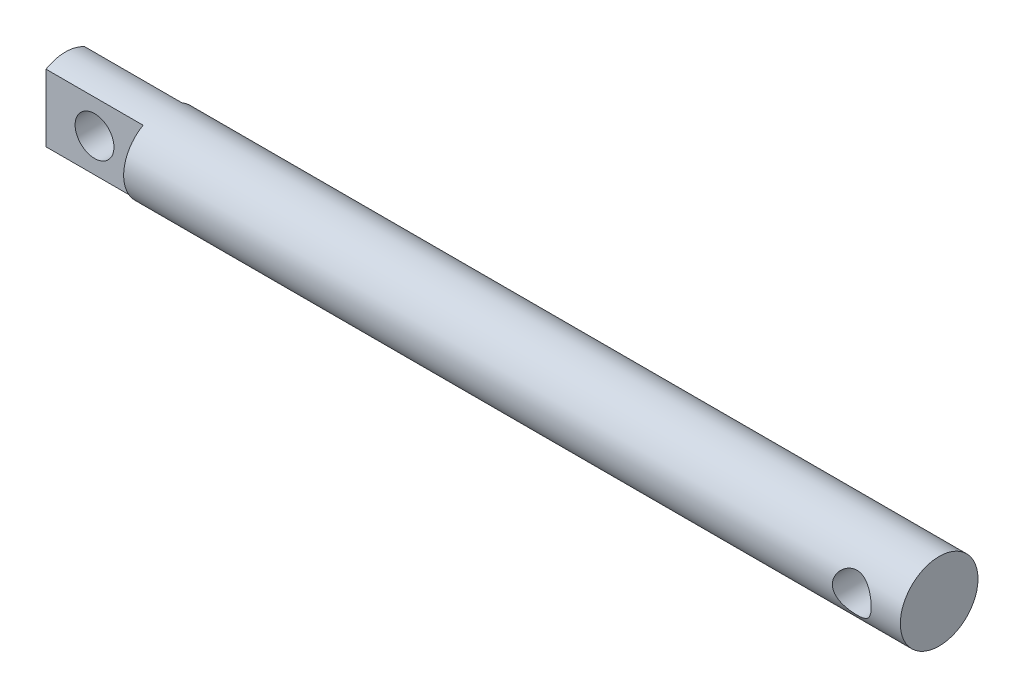
ISO-10303-21;
HEADER;
FILE_DESCRIPTION(('STEP AP214'),'2;1');
FILE_NAME('part.step','',(''),(''),'','','');
FILE_SCHEMA(('AUTOMOTIVE_DESIGN { 1 0 10303 214 1 1 1 1 }'));
ENDSEC;
DATA;
#1=APPLICATION_CONTEXT('core data for automotive mechanical design processes');
#2=APPLICATION_PROTOCOL_DEFINITION('international standard','automotive_design',2000,#1);
#3=PRODUCT_CONTEXT('',#1,'mechanical');
#4=PRODUCT('Part','Part','',(#3));
#5=PRODUCT_RELATED_PRODUCT_CATEGORY('part','',(#4));
#6=PRODUCT_DEFINITION_FORMATION('','',#4);
#7=PRODUCT_DEFINITION_CONTEXT('part definition',#1,'design');
#8=PRODUCT_DEFINITION('design','',#6,#7);
#9=PRODUCT_DEFINITION_SHAPE('','',#8);
#10=(LENGTH_UNIT() NAMED_UNIT(*) SI_UNIT(.MILLI.,.METRE.));
#11=(NAMED_UNIT(*) PLANE_ANGLE_UNIT() SI_UNIT($,.RADIAN.));
#12=(NAMED_UNIT(*) SI_UNIT($,.STERADIAN.) SOLID_ANGLE_UNIT());
#13=UNCERTAINTY_MEASURE_WITH_UNIT(LENGTH_MEASURE(1.E-05),#10,'distance_accuracy_value','');
#14=(GEOMETRIC_REPRESENTATION_CONTEXT(3) GLOBAL_UNCERTAINTY_ASSIGNED_CONTEXT((#13)) GLOBAL_UNIT_ASSIGNED_CONTEXT((#10,
#11,#12)) REPRESENTATION_CONTEXT('',''));
#15=CARTESIAN_POINT('',(0.,0.,0.));
#16=DIRECTION('',(0.,0.,1.));
#17=DIRECTION('',(1.,0.,0.));
#18=AXIS2_PLACEMENT_3D('',#15,#16,#17);
#19=CARTESIAN_POINT('',(180.,0.,0.));
#20=DIRECTION('',(-1.,0.,0.));
#21=DIRECTION('',(0.,0.,1.));
#22=AXIS2_PLACEMENT_3D('',#19,#20,#21);
#23=CYLINDRICAL_SURFACE('',#22,8.);
#24=CARTESIAN_POINT('',(174.,0.,-8.));
#25=CARTESIAN_POINT('',(173.999999595152,0.105191216468487,-7.99999964432188));
#26=CARTESIAN_POINT('',(173.995845542685,0.210389995368426,-7.99792027620652));
#27=CARTESIAN_POINT('',(173.979277921901,0.420011249701333,-7.98965597150982));
#28=CARTESIAN_POINT('',(173.96686076043,0.524433367425615,-7.98346924887743));
#29=CARTESIAN_POINT('',(173.933886485305,0.731828138370599,-7.96713597659603));
#30=CARTESIAN_POINT('',(173.913317763343,0.83479850671191,-7.956983780175));
#31=CARTESIAN_POINT('',(173.864282792444,1.03841520519549,-7.93298382243633));
#32=CARTESIAN_POINT('',(173.835813314936,1.1390605669938,-7.91913455043164));
#33=CARTESIAN_POINT('',(173.739251768882,1.43561775388138,-7.87265974292142));
#34=CARTESIAN_POINT('',(173.659837019153,1.6271962065847,-7.83501976471674));
#35=CARTESIAN_POINT('',(173.473710958912,1.9939214699542,-7.74982886318845));
#36=CARTESIAN_POINT('',(173.367001800619,2.16906957469773,-7.70227872135526));
#37=CARTESIAN_POINT('',(173.121930177401,2.51002321260362,-7.59825056785886));
#38=CARTESIAN_POINT('',(172.982043311806,2.67462250306453,-7.54140647262265));
#39=CARTESIAN_POINT('',(172.677924862414,2.97911611963431,-7.42640030348014));
#40=CARTESIAN_POINT('',(172.513674900957,3.11899161990724,-7.3682372629647));
#41=CARTESIAN_POINT('',(172.15002101287,3.38102385527715,-7.25195135134797));
#42=CARTESIAN_POINT('',(171.948878695725,3.50096528772936,-7.19418138823907));
#43=CARTESIAN_POINT('',(171.632065460046,3.65378721735264,-7.11709930290977));
#44=CARTESIAN_POINT('',(171.523905337193,3.70022392693971,-7.09299422837207));
#45=CARTESIAN_POINT('',(171.303199028921,3.78359067078056,-7.04887690211806));
#46=CARTESIAN_POINT('',(171.190655486078,3.82052633371564,-7.02886222858684));
#47=CARTESIAN_POINT('',(170.968805780694,3.88251046204453,-6.99480449986431));
#48=CARTESIAN_POINT('',(170.859703580835,3.90813408878039,-6.98047764468021));
#49=CARTESIAN_POINT('',(170.63925947718,3.9501806007294,-6.95677065788593));
#50=CARTESIAN_POINT('',(170.527918794247,3.9666083675027,-6.94738790188961));
#51=CARTESIAN_POINT('',(170.303993906534,3.99001913809428,-6.93396933490058));
#52=CARTESIAN_POINT('',(170.191410491912,3.99700782997251,-6.92993030376773));
#53=CARTESIAN_POINT('',(169.965999521961,4.0014434005985,-6.92737022415465));
#54=CARTESIAN_POINT('',(169.853171990953,3.99889118971827,-6.92884864921082));
#55=CARTESIAN_POINT('',(169.641835621554,3.98516575152015,-6.93675038555112));
#56=CARTESIAN_POINT('',(169.543232560428,3.9750632940758,-6.94255931040713));
#57=CARTESIAN_POINT('',(169.347348387834,3.94763759493624,-6.95818925294571));
#58=CARTESIAN_POINT('',(169.250067701479,3.93031208534669,-6.96801153072177));
#59=CARTESIAN_POINT('',(168.9612208671,3.86777248849783,-7.00304835203765));
#60=CARTESIAN_POINT('',(168.772504542919,3.81198555026408,-7.03383903740603));
#61=CARTESIAN_POINT('',(168.403053667229,3.67283599572518,-7.10749917506983));
#62=CARTESIAN_POINT('',(168.222607424652,3.58886132884632,-7.15063327143765));
#63=CARTESIAN_POINT('',(167.877469812985,3.39616568981263,-7.2441365265382));
#64=CARTESIAN_POINT('',(167.712785567935,3.28743360222606,-7.29450893132237));
#65=CARTESIAN_POINT('',(167.381917118295,3.03227252755195,-7.40452458073482));
#66=CARTESIAN_POINT('',(167.218190429292,2.88281182497071,-7.46453347888883));
#67=CARTESIAN_POINT('',(166.917040393499,2.55818830727484,-7.58191186589975));
#68=CARTESIAN_POINT('',(166.779629617526,2.38301327894513,-7.63928008344308));
#69=CARTESIAN_POINT('',(166.593246969786,2.09944472683199,-7.72027607686169));
#70=CARTESIAN_POINT('',(166.533318240247,1.99896799870131,-7.74696304862188));
#71=CARTESIAN_POINT('',(166.422233521223,1.79256850112004,-7.79730441532266));
#72=CARTESIAN_POINT('',(166.371073833602,1.68664805204878,-7.82096008757467));
#73=CARTESIAN_POINT('',(166.278080877627,1.47010242051539,-7.86454042959534));
#74=CARTESIAN_POINT('',(166.236243854867,1.35947915341348,-7.88446660078232));
#75=CARTESIAN_POINT('',(166.162380061448,1.13432950721218,-7.91999221203723));
#76=CARTESIAN_POINT('',(166.130352162241,1.01980357880329,-7.9355921498224));
#77=CARTESIAN_POINT('',(166.078773152145,0.797438403015345,-7.96087677585623));
#78=CARTESIAN_POINT('',(166.058408402943,0.689830906854578,-7.9709443603734));
#79=CARTESIAN_POINT('',(166.026553551758,0.472998720376389,-7.98674429615844));
#80=CARTESIAN_POINT('',(166.015062665263,0.363774173887731,-7.99247703065614));
#81=CARTESIAN_POINT('',(166.001109528455,0.144648447401179,-7.99944300548302));
#82=CARTESIAN_POINT('',(165.998643821621,0.0347475425961511,-8.00067796839692));
#83=CARTESIAN_POINT('',(166.00276424211,-0.184837638972482,-7.99861804620746));
#84=CARTESIAN_POINT('',(166.009349968837,-0.294521925108016,-7.99532336157662));
#85=CARTESIAN_POINT('',(166.030623569527,-0.504259611746534,-7.98472734940324));
#86=CARTESIAN_POINT('',(166.044641069104,-0.604398259266981,-7.97775776257091));
#87=CARTESIAN_POINT('',(166.080136399664,-0.803035609307665,-7.96021983565123));
#88=CARTESIAN_POINT('',(166.101616763793,-0.901533743070584,-7.94965027363514));
#89=CARTESIAN_POINT('',(166.1769351736,-1.19351737727532,-7.91289127905722));
#90=CARTESIAN_POINT('',(166.241670140591,-1.38368108667203,-7.88164133135127));
#91=CARTESIAN_POINT('',(166.399998108906,-1.75558493783056,-7.80736894774679));
#92=CARTESIAN_POINT('',(166.494363309172,-1.93692876519227,-7.76403545540106));
#93=CARTESIAN_POINT('',(166.70843103426,-2.2818382665657,-7.66975878800212));
#94=CARTESIAN_POINT('',(166.828144352632,-2.44539632212194,-7.61881237399844));
#95=CARTESIAN_POINT('',(167.103033119703,-2.76706877708065,-7.50833088367007));
#96=CARTESIAN_POINT('',(167.260536537259,-2.92307134240143,-7.44844369061623));
#97=CARTESIAN_POINT('',(167.599735565255,-3.20744226426286,-7.33048735856255));
#98=CARTESIAN_POINT('',(167.781447771603,-3.33579150415336,-7.27241950081065));
#99=CARTESIAN_POINT('',(168.073994014422,-3.50772930633182,-7.19028164087442));
#100=CARTESIAN_POINT('',(168.177483758436,-3.56261578679479,-7.16316684054652));
#101=CARTESIAN_POINT('',(168.389518435316,-3.66334616154281,-7.11217812644118));
#102=CARTESIAN_POINT('',(168.498060900095,-3.70919441458265,-7.08830265221425));
#103=CARTESIAN_POINT('',(168.719421645364,-3.79131200961918,-7.04472262103752));
#104=CARTESIAN_POINT('',(168.832236409795,-3.82758904080801,-7.02501471854546));
#105=CARTESIAN_POINT('',(169.061352789071,-3.89012004539428,-6.9905825381999));
#106=CARTESIAN_POINT('',(169.177653861022,-3.91637557070637,-6.97585748874971));
#107=CARTESIAN_POINT('',(169.401412133163,-3.95643062416586,-6.95321025619991));
#108=CARTESIAN_POINT('',(169.508646832908,-3.9711837819252,-6.9447707979206));
#109=CARTESIAN_POINT('',(169.724227670201,-3.9919511831707,-6.93285441469715));
#110=CARTESIAN_POINT('',(169.832573690101,-3.9979663422549,-6.92937696981659));
#111=CARTESIAN_POINT('',(170.04940749673,-4.00116308319382,-6.92753208063799));
#112=CARTESIAN_POINT('',(170.157895220223,-3.99834777004018,-6.9291628401807));
#113=CARTESIAN_POINT('',(170.374061147113,-3.98394653809981,-6.93745093481981));
#114=CARTESIAN_POINT('',(170.481739383469,-3.97236097836302,-6.94410806413885));
#115=CARTESIAN_POINT('',(170.781800137041,-3.92770249100378,-6.9695287958286));
#116=CARTESIAN_POINT('',(170.972365867314,-3.88483285002042,-6.99372760142387));
#117=CARTESIAN_POINT('',(171.343268502553,-3.77270184038046,-7.05483682415845));
#118=CARTESIAN_POINT('',(171.523602095704,-3.70343198216887,-7.09175132993569));
#119=CARTESIAN_POINT('',(171.882488553514,-3.53526338936952,-7.17714225279385));
#120=CARTESIAN_POINT('',(172.060107775762,-3.43468670285354,-7.22622883383997));
#121=CARTESIAN_POINT('',(172.397101978277,-3.20860173383708,-7.3294133274236));
#122=CARTESIAN_POINT('',(172.556467398541,-3.08308048046464,-7.38351383930109));
#123=CARTESIAN_POINT('',(172.872562909038,-2.79282250805389,-7.49849148240842));
#124=CARTESIAN_POINT('',(173.026619929624,-2.62517402605099,-7.55939328373464));
#125=CARTESIAN_POINT('',(173.305068422813,-2.26458287075638,-7.67511613929542));
#126=CARTESIAN_POINT('',(173.429443905242,-2.07162664990559,-7.72993390744395));
#127=CARTESIAN_POINT('',(173.590904249415,-1.76603106757847,-7.80335210517359));
#128=CARTESIAN_POINT('',(173.640693641409,-1.66100410373828,-7.82643367929071));
#129=CARTESIAN_POINT('',(173.731148947001,-1.44639623629745,-7.8689179624278));
#130=CARTESIAN_POINT('',(173.771819342698,-1.33681760142933,-7.88832247803741));
#131=CARTESIAN_POINT('',(173.843476344434,-1.11415600876094,-7.92283587265691));
#132=CARTESIAN_POINT('',(173.874484071387,-1.00108129646084,-7.93795411409434));
#133=CARTESIAN_POINT('',(173.926510080016,-0.772189766950852,-7.96347694583626));
#134=CARTESIAN_POINT('',(173.947534463772,-0.656374670304628,-7.97388441530453));
#135=CARTESIAN_POINT('',(173.975579621199,-0.450433316283317,-7.98781110043794));
#136=CARTESIAN_POINT('',(173.984729389176,-0.360660623567822,-7.99237392421376));
#137=CARTESIAN_POINT('',(173.996939836378,-0.180593821057093,-7.99846856848791));
#138=CARTESIAN_POINT('',(174.000000347535,-0.090299696938969,-8.00000030532612));
#139=CARTESIAN_POINT('',(174.,0.,-8.));
#140=B_SPLINE_CURVE_WITH_KNOTS('',3,(#24,#25,#26,#27,#28,#29,#30,#31,#32,#33,#34,#35,#36,#37,
#38,#39,#40,#41,#42,#43,#44,#45,#46,#47,#48,#49,#50,#51,#52,#53,#54,#55,#56,#57,#58,#59,#60,#61,
#62,#63,#64,#65,#66,#67,#68,#69,#70,#71,#72,#73,#74,#75,#76,#77,#78,#79,#80,#81,#82,#83,#84,#85,
#86,#87,#88,#89,#90,#91,#92,#93,#94,#95,#96,#97,#98,#99,#100,#101,#102,#103,#104,#105,#106,#107,
#108,#109,#110,#111,#112,#113,#114,#115,#116,#117,#118,#119,#120,#121,#122,#123,#124,#125,#126,
#127,#128,#129,#130,#131,#132,#133,#134,#135,#136,#137,#138,#139),.UNSPECIFIED.,.T.,.F.,(4,2,2,
2,2,2,2,2,2,2,2,2,2,2,2,2,2,2,2,2,2,2,2,2,2,2,2,2,2,2,2,2,2,2,2,2,2,2,2,2,2,2,2,2,2,2,2,2,2,2,2,
2,2,2,2,2,2,4),(0.,0.315484235719908,0.631105747230254,0.947178346952264,1.26338029745354,
1.89263632058595,2.52184274094301,3.18911473348912,3.85689264923288,4.57645675584684,
4.93648208726456,5.29629363598333,5.63476191634048,5.97305035229573,6.31113484191763,
6.64918707308221,6.94669148652855,7.24428938086226,7.83905304157541,8.44767049128774,
9.05656173495713,9.74265853790339,10.4290822684957,10.7886699173094,11.1481055433964,
11.5073961555811,11.8666454155398,12.1961419049362,12.5256092612256,12.8549504227675,
13.184277008843,13.4879760335491,13.791778244799,14.3988188497913,15.02321622567,
15.6478800144876,16.33388641032,17.0203655291612,17.380682030865,17.7408243397693,
18.1006764355617,18.4604727825931,18.7857371805983,19.1109674938045,19.4360834615763,
19.7611861199664,20.3488209353335,20.9366448769133,21.5639619965907,22.1916061711245,
22.8955134356508,23.5997990605887,23.9548906509476,24.3098073249809,24.6639426811875,
25.0178613011448,25.2886761616555,25.5594984967415),.UNSPECIFIED.);
#141=CARTESIAN_POINT('',(174.,0.,-8.));
#142=VERTEX_POINT('',#141);
#143=EDGE_CURVE('E106',#142,#142,#140,.T.);
#144=ORIENTED_EDGE('',*,*,#143,.T.);
#145=EDGE_LOOP('',(#144));
#146=FACE_BOUND('',#145,.T.);
#147=CARTESIAN_POINT('',(174.,0.,8.));
#148=CARTESIAN_POINT('',(173.999999595152,-0.105191216468487,7.99999964432188));
#149=CARTESIAN_POINT('',(173.995845542685,-0.210389995368426,7.99792027620652));
#150=CARTESIAN_POINT('',(173.979277921901,-0.420011249701333,7.98965597150982));
#151=CARTESIAN_POINT('',(173.96686076043,-0.524433367425615,7.98346924887743));
#152=CARTESIAN_POINT('',(173.933886485305,-0.731828138370599,7.96713597659603));
#153=CARTESIAN_POINT('',(173.913317763343,-0.83479850671191,7.956983780175));
#154=CARTESIAN_POINT('',(173.864282792444,-1.03841520519549,7.93298382243633));
#155=CARTESIAN_POINT('',(173.835813314936,-1.1390605669938,7.91913455043164));
#156=CARTESIAN_POINT('',(173.739251768882,-1.43561775388138,7.87265974292142));
#157=CARTESIAN_POINT('',(173.659837019153,-1.6271962065847,7.83501976471674));
#158=CARTESIAN_POINT('',(173.473710958912,-1.9939214699542,7.74982886318845));
#159=CARTESIAN_POINT('',(173.367001800619,-2.16906957469773,7.70227872135526));
#160=CARTESIAN_POINT('',(173.121930177401,-2.51002321260362,7.59825056785886));
#161=CARTESIAN_POINT('',(172.982043311806,-2.67462250306453,7.54140647262265));
#162=CARTESIAN_POINT('',(172.677924862414,-2.97911611963431,7.42640030348014));
#163=CARTESIAN_POINT('',(172.513674900957,-3.11899161990724,7.3682372629647));
#164=CARTESIAN_POINT('',(172.15002101287,-3.38102385527715,7.25195135134797));
#165=CARTESIAN_POINT('',(171.948878695725,-3.50096528772936,7.19418138823907));
#166=CARTESIAN_POINT('',(171.632065460046,-3.65378721735264,7.11709930290977));
#167=CARTESIAN_POINT('',(171.523905337193,-3.70022392693971,7.09299422837207));
#168=CARTESIAN_POINT('',(171.303199028921,-3.78359067078056,7.04887690211806));
#169=CARTESIAN_POINT('',(171.190655486078,-3.82052633371564,7.02886222858684));
#170=CARTESIAN_POINT('',(170.968805780694,-3.88251046204453,6.99480449986431));
#171=CARTESIAN_POINT('',(170.859703580835,-3.90813408878039,6.98047764468021));
#172=CARTESIAN_POINT('',(170.63925947718,-3.9501806007294,6.95677065788593));
#173=CARTESIAN_POINT('',(170.527918794247,-3.9666083675027,6.94738790188961));
#174=CARTESIAN_POINT('',(170.303993906534,-3.99001913809428,6.93396933490058));
#175=CARTESIAN_POINT('',(170.191410491912,-3.99700782997251,6.92993030376773));
#176=CARTESIAN_POINT('',(169.965999521961,-4.0014434005985,6.92737022415465));
#177=CARTESIAN_POINT('',(169.853171990953,-3.99889118971827,6.92884864921082));
#178=CARTESIAN_POINT('',(169.641835621554,-3.98516575152015,6.93675038555112));
#179=CARTESIAN_POINT('',(169.543232560428,-3.9750632940758,6.94255931040713));
#180=CARTESIAN_POINT('',(169.347348387834,-3.94763759493624,6.95818925294571));
#181=CARTESIAN_POINT('',(169.250067701479,-3.93031208534669,6.96801153072177));
#182=CARTESIAN_POINT('',(168.9612208671,-3.86777248849783,7.00304835203765));
#183=CARTESIAN_POINT('',(168.772504542919,-3.81198555026408,7.03383903740603));
#184=CARTESIAN_POINT('',(168.403053667229,-3.67283599572518,7.10749917506983));
#185=CARTESIAN_POINT('',(168.222607424652,-3.58886132884632,7.15063327143765));
#186=CARTESIAN_POINT('',(167.877469812985,-3.39616568981263,7.2441365265382));
#187=CARTESIAN_POINT('',(167.712785567935,-3.28743360222606,7.29450893132237));
#188=CARTESIAN_POINT('',(167.381917118295,-3.03227252755195,7.40452458073482));
#189=CARTESIAN_POINT('',(167.218190429292,-2.88281182497071,7.46453347888883));
#190=CARTESIAN_POINT('',(166.917040393499,-2.55818830727484,7.58191186589975));
#191=CARTESIAN_POINT('',(166.779629617526,-2.38301327894513,7.63928008344308));
#192=CARTESIAN_POINT('',(166.593246969786,-2.09944472683199,7.72027607686169));
#193=CARTESIAN_POINT('',(166.533318240247,-1.99896799870131,7.74696304862188));
#194=CARTESIAN_POINT('',(166.422233521223,-1.79256850112004,7.79730441532266));
#195=CARTESIAN_POINT('',(166.371073833602,-1.68664805204878,7.82096008757467));
#196=CARTESIAN_POINT('',(166.278080877627,-1.47010242051539,7.86454042959534));
#197=CARTESIAN_POINT('',(166.236243854867,-1.35947915341348,7.88446660078232));
#198=CARTESIAN_POINT('',(166.162380061448,-1.13432950721218,7.91999221203723));
#199=CARTESIAN_POINT('',(166.130352162241,-1.01980357880329,7.9355921498224));
#200=CARTESIAN_POINT('',(166.078773152145,-0.797438403015345,7.96087677585623));
#201=CARTESIAN_POINT('',(166.058408402943,-0.689830906854578,7.9709443603734));
#202=CARTESIAN_POINT('',(166.026553551758,-0.472998720376389,7.98674429615844));
#203=CARTESIAN_POINT('',(166.015062665263,-0.363774173887731,7.99247703065614));
#204=CARTESIAN_POINT('',(166.001109528455,-0.144648447401179,7.99944300548302));
#205=CARTESIAN_POINT('',(165.998643821621,-0.0347475425961511,8.00067796839692));
#206=CARTESIAN_POINT('',(166.00276424211,0.184837638972482,7.99861804620746));
#207=CARTESIAN_POINT('',(166.009349968837,0.294521925108016,7.99532336157662));
#208=CARTESIAN_POINT('',(166.030623569527,0.504259611746534,7.98472734940324));
#209=CARTESIAN_POINT('',(166.044641069104,0.604398259266981,7.97775776257091));
#210=CARTESIAN_POINT('',(166.080136399664,0.803035609307665,7.96021983565123));
#211=CARTESIAN_POINT('',(166.101616763793,0.901533743070584,7.94965027363514));
#212=CARTESIAN_POINT('',(166.1769351736,1.19351737727532,7.91289127905722));
#213=CARTESIAN_POINT('',(166.241670140591,1.38368108667203,7.88164133135127));
#214=CARTESIAN_POINT('',(166.399998108906,1.75558493783056,7.80736894774679));
#215=CARTESIAN_POINT('',(166.494363309172,1.93692876519227,7.76403545540106));
#216=CARTESIAN_POINT('',(166.70843103426,2.2818382665657,7.66975878800212));
#217=CARTESIAN_POINT('',(166.828144352632,2.44539632212194,7.61881237399844));
#218=CARTESIAN_POINT('',(167.103033119703,2.76706877708065,7.50833088367007));
#219=CARTESIAN_POINT('',(167.260536537259,2.92307134240143,7.44844369061623));
#220=CARTESIAN_POINT('',(167.599735565255,3.20744226426286,7.33048735856255));
#221=CARTESIAN_POINT('',(167.781447771603,3.33579150415336,7.27241950081065));
#222=CARTESIAN_POINT('',(168.073994014422,3.50772930633182,7.19028164087442));
#223=CARTESIAN_POINT('',(168.177483758436,3.56261578679479,7.16316684054652));
#224=CARTESIAN_POINT('',(168.389518435316,3.66334616154281,7.11217812644118));
#225=CARTESIAN_POINT('',(168.498060900095,3.70919441458265,7.08830265221425));
#226=CARTESIAN_POINT('',(168.719421645364,3.79131200961918,7.04472262103752));
#227=CARTESIAN_POINT('',(168.832236409795,3.82758904080801,7.02501471854546));
#228=CARTESIAN_POINT('',(169.061352789071,3.89012004539428,6.9905825381999));
#229=CARTESIAN_POINT('',(169.177653861022,3.91637557070637,6.97585748874971));
#230=CARTESIAN_POINT('',(169.401412133163,3.95643062416586,6.95321025619991));
#231=CARTESIAN_POINT('',(169.508646832908,3.9711837819252,6.9447707979206));
#232=CARTESIAN_POINT('',(169.724227670201,3.9919511831707,6.93285441469715));
#233=CARTESIAN_POINT('',(169.832573690101,3.9979663422549,6.92937696981659));
#234=CARTESIAN_POINT('',(170.04940749673,4.00116308319382,6.92753208063799));
#235=CARTESIAN_POINT('',(170.157895220223,3.99834777004018,6.9291628401807));
#236=CARTESIAN_POINT('',(170.374061147113,3.98394653809981,6.93745093481981));
#237=CARTESIAN_POINT('',(170.481739383469,3.97236097836302,6.94410806413885));
#238=CARTESIAN_POINT('',(170.781800137041,3.92770249100378,6.9695287958286));
#239=CARTESIAN_POINT('',(170.972365867314,3.88483285002042,6.99372760142387));
#240=CARTESIAN_POINT('',(171.343268502553,3.77270184038046,7.05483682415845));
#241=CARTESIAN_POINT('',(171.523602095704,3.70343198216887,7.09175132993569));
#242=CARTESIAN_POINT('',(171.882488553514,3.53526338936952,7.17714225279385));
#243=CARTESIAN_POINT('',(172.060107775762,3.43468670285354,7.22622883383997));
#244=CARTESIAN_POINT('',(172.397101978277,3.20860173383708,7.3294133274236));
#245=CARTESIAN_POINT('',(172.556467398541,3.08308048046464,7.38351383930109));
#246=CARTESIAN_POINT('',(172.872562909038,2.79282250805389,7.49849148240842));
#247=CARTESIAN_POINT('',(173.026619929624,2.62517402605099,7.55939328373464));
#248=CARTESIAN_POINT('',(173.305068422813,2.26458287075638,7.67511613929542));
#249=CARTESIAN_POINT('',(173.429443905242,2.07162664990559,7.72993390744395));
#250=CARTESIAN_POINT('',(173.590904249415,1.76603106757847,7.80335210517359));
#251=CARTESIAN_POINT('',(173.640693641409,1.66100410373828,7.82643367929071));
#252=CARTESIAN_POINT('',(173.731148947001,1.44639623629745,7.8689179624278));
#253=CARTESIAN_POINT('',(173.771819342698,1.33681760142933,7.88832247803741));
#254=CARTESIAN_POINT('',(173.843476344434,1.11415600876094,7.92283587265691));
#255=CARTESIAN_POINT('',(173.874484071387,1.00108129646084,7.93795411409434));
#256=CARTESIAN_POINT('',(173.926510080016,0.772189766950852,7.96347694583626));
#257=CARTESIAN_POINT('',(173.947534463772,0.656374670304628,7.97388441530453));
#258=CARTESIAN_POINT('',(173.975579621199,0.450433316283317,7.98781110043794));
#259=CARTESIAN_POINT('',(173.984729389176,0.360660623567822,7.99237392421376));
#260=CARTESIAN_POINT('',(173.996939836378,0.180593821057093,7.99846856848791));
#261=CARTESIAN_POINT('',(174.000000347535,0.090299696938969,8.00000030532612));
#262=CARTESIAN_POINT('',(174.,0.,8.));
#263=B_SPLINE_CURVE_WITH_KNOTS('',3,(#147,#148,#149,#150,#151,#152,#153,#154,#155,#156,#157,
#158,#159,#160,#161,#162,#163,#164,#165,#166,#167,#168,#169,#170,#171,#172,#173,#174,#175,#176,
#177,#178,#179,#180,#181,#182,#183,#184,#185,#186,#187,#188,#189,#190,#191,#192,#193,#194,#195,
#196,#197,#198,#199,#200,#201,#202,#203,#204,#205,#206,#207,#208,#209,#210,#211,#212,#213,#214,
#215,#216,#217,#218,#219,#220,#221,#222,#223,#224,#225,#226,#227,#228,#229,#230,#231,#232,#233,
#234,#235,#236,#237,#238,#239,#240,#241,#242,#243,#244,#245,#246,#247,#248,#249,#250,#251,#252,
#253,#254,#255,#256,#257,#258,#259,#260,#261,#262),.UNSPECIFIED.,.T.,.F.,(4,2,2,2,2,2,2,2,2,2,2,
2,2,2,2,2,2,2,2,2,2,2,2,2,2,2,2,2,2,2,2,2,2,2,2,2,2,2,2,2,2,2,2,2,2,2,2,2,2,2,2,2,2,2,2,2,2,4),
(0.,0.315484235719908,0.631105747230254,0.947178346952264,1.26338029745354,1.89263632058595,
2.52184274094301,3.18911473348912,3.85689264923288,4.57645675584684,4.93648208726456,
5.29629363598333,5.63476191634048,5.97305035229573,6.31113484191763,6.64918707308221,
6.94669148652855,7.24428938086226,7.83905304157541,8.44767049128774,9.05656173495713,
9.74265853790339,10.4290822684957,10.7886699173094,11.1481055433964,11.5073961555811,
11.8666454155398,12.1961419049362,12.5256092612256,12.8549504227675,13.184277008843,
13.4879760335491,13.791778244799,14.3988188497913,15.02321622567,15.6478800144876,
16.33388641032,17.0203655291612,17.380682030865,17.7408243397693,18.1006764355617,
18.4604727825931,18.7857371805983,19.1109674938045,19.4360834615763,19.7611861199664,
20.3488209353335,20.9366448769133,21.5639619965907,22.1916061711245,22.8955134356508,
23.5997990605887,23.9548906509476,24.3098073249809,24.6639426811875,25.0178613011448,
25.2886761616555,25.5594984967415),.UNSPECIFIED.);
#264=CARTESIAN_POINT('',(174.,0.,8.));
#265=VERTEX_POINT('',#264);
#266=EDGE_CURVE('E97',#265,#265,#263,.T.);
#267=ORIENTED_EDGE('',*,*,#266,.T.);
#268=EDGE_LOOP('',(#267));
#269=FACE_BOUND('',#268,.T.);
#270=CARTESIAN_POINT('',(180.,0.,0.));
#271=DIRECTION('',(1.,0.,0.));
#272=DIRECTION('',(0.,0.,-1.));
#273=AXIS2_PLACEMENT_3D('',#270,#271,#272);
#274=CIRCLE('',#273,8.);
#275=CARTESIAN_POINT('',(180.,0.,-8.));
#276=VERTEX_POINT('',#275);
#277=EDGE_CURVE('E93',#276,#276,#274,.T.);
#278=ORIENTED_EDGE('',*,*,#277,.F.);
#279=EDGE_LOOP('',(#278));
#280=FACE_BOUND('',#279,.T.);
#281=DIRECTION('',(-1.,0.,0.));
#282=VECTOR('',#281,1.);
#283=CARTESIAN_POINT('',(180.,6.92820323027551,4.));
#284=LINE('',#283,#282);
#285=CARTESIAN_POINT('',(20.,6.92820323027551,4.));
#286=VERTEX_POINT('',#285);
#287=CARTESIAN_POINT('',(0.,6.92820323027551,4.));
#288=VERTEX_POINT('',#287);
#289=EDGE_CURVE('E58',#286,#288,#284,.T.);
#290=ORIENTED_EDGE('',*,*,#289,.F.);
#291=CARTESIAN_POINT('',(20.,0.,0.));
#292=DIRECTION('',(-1.,0.,0.));
#293=DIRECTION('',(0.,0.,1.));
#294=AXIS2_PLACEMENT_3D('',#291,#292,#293);
#295=CIRCLE('',#294,8.);
#296=CARTESIAN_POINT('',(20.,-6.92820323027551,4.));
#297=VERTEX_POINT('',#296);
#298=EDGE_CURVE('E12',#297,#286,#295,.T.);
#299=ORIENTED_EDGE('',*,*,#298,.F.);
#300=DIRECTION('',(-1.,0.,0.));
#301=VECTOR('',#300,1.);
#302=CARTESIAN_POINT('',(180.,-6.92820323027551,4.));
#303=LINE('',#302,#301);
#304=CARTESIAN_POINT('',(0.,-6.92820323027551,4.));
#305=VERTEX_POINT('',#304);
#306=EDGE_CURVE('E148',#305,#297,#303,.F.);
#307=ORIENTED_EDGE('',*,*,#306,.F.);
#308=CARTESIAN_POINT('',(0.,0.,0.));
#309=DIRECTION('',(1.,0.,0.));
#310=DIRECTION('',(0.,0.,-1.));
#311=AXIS2_PLACEMENT_3D('',#308,#309,#310);
#312=CIRCLE('',#311,8.);
#313=CARTESIAN_POINT('',(0.,-6.92820323027551,-4.));
#314=VERTEX_POINT('',#313);
#315=EDGE_CURVE('E94',#305,#314,#312,.T.);
#316=ORIENTED_EDGE('',*,*,#315,.T.);
#317=DIRECTION('',(-1.,0.,0.));
#318=VECTOR('',#317,1.);
#319=CARTESIAN_POINT('',(180.,-6.92820323027551,-4.));
#320=LINE('',#319,#318);
#321=CARTESIAN_POINT('',(20.,-6.92820323027551,-4.));
#322=VERTEX_POINT('',#321);
#323=EDGE_CURVE('E50',#322,#314,#320,.T.);
#324=ORIENTED_EDGE('',*,*,#323,.F.);
#325=CARTESIAN_POINT('',(20.,6.92820323027551,-4.));
#326=VERTEX_POINT('',#325);
#327=EDGE_CURVE('E39',#326,#322,#295,.T.);
#328=ORIENTED_EDGE('',*,*,#327,.F.);
#329=DIRECTION('',(-1.,0.,0.));
#330=VECTOR('',#329,1.);
#331=CARTESIAN_POINT('',(180.,6.92820323027551,-4.));
#332=LINE('',#331,#330);
#333=CARTESIAN_POINT('',(0.,6.92820323027551,-4.));
#334=VERTEX_POINT('',#333);
#335=EDGE_CURVE('E77',#334,#326,#332,.F.);
#336=ORIENTED_EDGE('',*,*,#335,.F.);
#337=EDGE_CURVE('E89',#334,#288,#312,.T.);
#338=ORIENTED_EDGE('',*,*,#337,.T.);
#339=EDGE_LOOP('',(#290,#299,#307,#316,#324,#328,#336,#338));
#340=FACE_BOUND('',#339,.T.);
#341=ADVANCED_FACE('F35',(#146,#269,#280,#340),#23,.T.);
#342=CARTESIAN_POINT('',(0.,0.,0.));
#343=DIRECTION('',(1.,0.,0.));
#344=DIRECTION('',(0.,0.,-1.));
#345=AXIS2_PLACEMENT_3D('',#342,#343,#344);
#346=PLANE('',#345);
#347=DIRECTION('',(0.,1.,0.));
#348=VECTOR('',#347,1.);
#349=CARTESIAN_POINT('',(0.,10.,4.));
#350=LINE('',#349,#348);
#351=EDGE_CURVE('E84',#305,#288,#350,.T.);
#352=ORIENTED_EDGE('',*,*,#351,.T.);
#353=ORIENTED_EDGE('',*,*,#337,.F.);
#354=DIRECTION('',(0.,-1.,0.));
#355=VECTOR('',#354,1.);
#356=CARTESIAN_POINT('',(0.,10.,-4.));
#357=LINE('',#356,#355);
#358=EDGE_CURVE('E74',#334,#314,#357,.T.);
#359=ORIENTED_EDGE('',*,*,#358,.T.);
#360=ORIENTED_EDGE('',*,*,#315,.F.);
#361=EDGE_LOOP('',(#352,#353,#359,#360));
#362=FACE_BOUND('',#361,.T.);
#363=ADVANCED_FACE('F92',(#362),#346,.F.);
#364=CARTESIAN_POINT('',(180.,0.,0.));
#365=DIRECTION('',(1.,0.,0.));
#366=DIRECTION('',(0.,0.,-1.));
#367=AXIS2_PLACEMENT_3D('',#364,#365,#366);
#368=PLANE('',#367);
#369=ORIENTED_EDGE('',*,*,#277,.T.);
#370=EDGE_LOOP('',(#369));
#371=FACE_BOUND('',#370,.T.);
#372=ADVANCED_FACE('F115',(#371),#368,.T.);
#373=CARTESIAN_POINT('',(170.,0.,-8.));
#374=DIRECTION('',(0.,0.,1.));
#375=DIRECTION('',(1.,0.,0.));
#376=AXIS2_PLACEMENT_3D('',#373,#374,#375);
#377=CYLINDRICAL_SURFACE('',#376,3.99999999999999);
#378=ORIENTED_EDGE('',*,*,#143,.F.);
#379=EDGE_LOOP('',(#378));
#380=FACE_BOUND('',#379,.T.);
#381=ORIENTED_EDGE('',*,*,#266,.F.);
#382=EDGE_LOOP('',(#381));
#383=FACE_BOUND('',#382,.T.);
#384=ADVANCED_FACE('F110',(#380,#383),#377,.F.);
#385=CARTESIAN_POINT('',(20.,10.,-4.));
#386=DIRECTION('',(0.,0.,-1.));
#387=DIRECTION('',(0.,1.,0.));
#388=AXIS2_PLACEMENT_3D('',#385,#386,#387);
#389=PLANE('',#388);
#390=CARTESIAN_POINT('',(10.,0.,-4.));
#391=DIRECTION('',(0.,0.,-1.));
#392=DIRECTION('',(0.,1.,0.));
#393=AXIS2_PLACEMENT_3D('',#390,#391,#392);
#394=CIRCLE('',#393,4.);
#395=CARTESIAN_POINT('',(10.,4.,-4.));
#396=VERTEX_POINT('',#395);
#397=EDGE_CURVE('E90',#396,#396,#394,.F.);
#398=ORIENTED_EDGE('',*,*,#397,.T.);
#399=EDGE_LOOP('',(#398));
#400=FACE_BOUND('',#399,.T.);
#401=ORIENTED_EDGE('',*,*,#323,.T.);
#402=ORIENTED_EDGE('',*,*,#358,.F.);
#403=ORIENTED_EDGE('',*,*,#335,.T.);
#404=DIRECTION('',(0.,-1.,0.));
#405=VECTOR('',#404,1.);
#406=CARTESIAN_POINT('',(20.,10.,-4.));
#407=LINE('',#406,#405);
#408=EDGE_CURVE('E142',#326,#322,#407,.T.);
#409=ORIENTED_EDGE('',*,*,#408,.T.);
#410=EDGE_LOOP('',(#401,#402,#403,#409));
#411=FACE_BOUND('',#410,.T.);
#412=ADVANCED_FACE('F76',(#400,#411),#389,.T.);
#413=CARTESIAN_POINT('',(20.,0.,0.));
#414=DIRECTION('',(-1.,0.,0.));
#415=DIRECTION('',(0.,0.,1.));
#416=AXIS2_PLACEMENT_3D('',#413,#414,#415);
#417=PLANE('',#416);
#418=ORIENTED_EDGE('',*,*,#327,.T.);
#419=ORIENTED_EDGE('',*,*,#408,.F.);
#420=EDGE_LOOP('',(#418,#419));
#421=FACE_BOUND('',#420,.T.);
#422=ADVANCED_FACE('F117',(#421),#417,.T.);
#423=ORIENTED_EDGE('',*,*,#298,.T.);
#424=DIRECTION('',(0.,1.,0.));
#425=VECTOR('',#424,1.);
#426=CARTESIAN_POINT('',(20.,10.,4.));
#427=LINE('',#426,#425);
#428=EDGE_CURVE('E83',#297,#286,#427,.T.);
#429=ORIENTED_EDGE('',*,*,#428,.F.);
#430=EDGE_LOOP('',(#423,#429));
#431=FACE_BOUND('',#430,.T.);
#432=ADVANCED_FACE('F153',(#431),#417,.T.);
#433=CARTESIAN_POINT('',(20.,10.,4.));
#434=DIRECTION('',(0.,0.,1.));
#435=DIRECTION('',(0.,-1.,0.));
#436=AXIS2_PLACEMENT_3D('',#433,#434,#435);
#437=PLANE('',#436);
#438=CARTESIAN_POINT('',(10.,0.,4.));
#439=DIRECTION('',(0.,0.,1.));
#440=DIRECTION('',(0.,-1.,0.));
#441=AXIS2_PLACEMENT_3D('',#438,#439,#440);
#442=CIRCLE('',#441,4.);
#443=CARTESIAN_POINT('',(10.,-4.,4.));
#444=VERTEX_POINT('',#443);
#445=EDGE_CURVE('E145',#444,#444,#442,.F.);
#446=ORIENTED_EDGE('',*,*,#445,.T.);
#447=EDGE_LOOP('',(#446));
#448=FACE_BOUND('',#447,.T.);
#449=ORIENTED_EDGE('',*,*,#289,.T.);
#450=ORIENTED_EDGE('',*,*,#351,.F.);
#451=ORIENTED_EDGE('',*,*,#306,.T.);
#452=ORIENTED_EDGE('',*,*,#428,.T.);
#453=EDGE_LOOP('',(#449,#450,#451,#452));
#454=FACE_BOUND('',#453,.T.);
#455=ADVANCED_FACE('F123',(#448,#454),#437,.T.);
#456=CARTESIAN_POINT('',(10.,0.,-8.));
#457=DIRECTION('',(0.,0.,1.));
#458=DIRECTION('',(1.,0.,0.));
#459=AXIS2_PLACEMENT_3D('',#456,#457,#458);
#460=CYLINDRICAL_SURFACE('',#459,4.);
#461=ORIENTED_EDGE('',*,*,#397,.F.);
#462=EDGE_LOOP('',(#461));
#463=FACE_BOUND('',#462,.T.);
#464=ORIENTED_EDGE('',*,*,#445,.F.);
#465=EDGE_LOOP('',(#464));
#466=FACE_BOUND('',#465,.T.);
#467=ADVANCED_FACE('F119',(#463,#466),#460,.F.);
#468=CLOSED_SHELL('',(#341,#363,#372,#384,#412,#422,#432,#455,#467));
#469=MANIFOLD_SOLID_BREP('B2',#468);
#470=ADVANCED_BREP_SHAPE_REPRESENTATION('',(#18,#469),#14);
#471=SHAPE_DEFINITION_REPRESENTATION(#9,#470);
ENDSEC;
END-ISO-10303-21;
